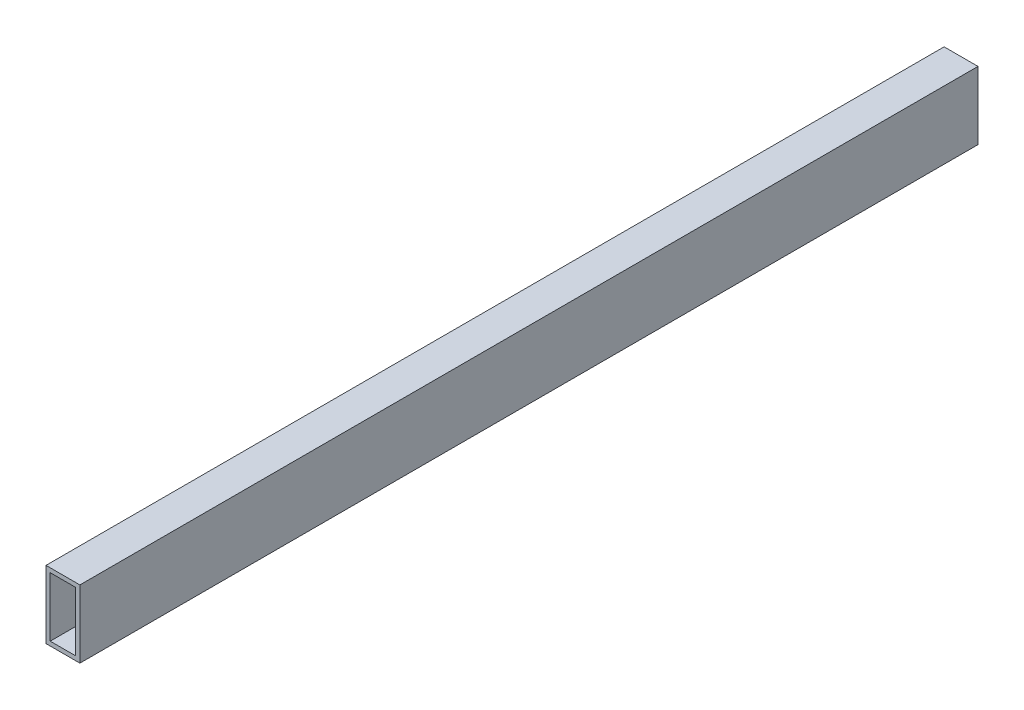
ISO-10303-21;
HEADER;
FILE_DESCRIPTION(('STEP AP214'),'2;1');
FILE_NAME('part.step','',(''),(''),'','','');
FILE_SCHEMA(('AUTOMOTIVE_DESIGN { 1 0 10303 214 1 1 1 1 }'));
ENDSEC;
DATA;
#1=APPLICATION_CONTEXT('core data for automotive mechanical design processes');
#2=APPLICATION_PROTOCOL_DEFINITION('international standard','automotive_design',2000,#1);
#3=PRODUCT_CONTEXT('',#1,'mechanical');
#4=PRODUCT('Part','Part','',(#3));
#5=PRODUCT_RELATED_PRODUCT_CATEGORY('part','',(#4));
#6=PRODUCT_DEFINITION_FORMATION('','',#4);
#7=PRODUCT_DEFINITION_CONTEXT('part definition',#1,'design');
#8=PRODUCT_DEFINITION('design','',#6,#7);
#9=PRODUCT_DEFINITION_SHAPE('','',#8);
#10=(LENGTH_UNIT() NAMED_UNIT(*) SI_UNIT(.MILLI.,.METRE.));
#11=(NAMED_UNIT(*) PLANE_ANGLE_UNIT() SI_UNIT($,.RADIAN.));
#12=(NAMED_UNIT(*) SI_UNIT($,.STERADIAN.) SOLID_ANGLE_UNIT());
#13=UNCERTAINTY_MEASURE_WITH_UNIT(LENGTH_MEASURE(1.E-05),#10,'distance_accuracy_value','');
#14=(GEOMETRIC_REPRESENTATION_CONTEXT(3) GLOBAL_UNCERTAINTY_ASSIGNED_CONTEXT((#13)) GLOBAL_UNIT_ASSIGNED_CONTEXT((#10,
#11,#12)) REPRESENTATION_CONTEXT('',''));
#15=CARTESIAN_POINT('',(0.,0.,0.));
#16=DIRECTION('',(0.,0.,1.));
#17=DIRECTION('',(1.,0.,0.));
#18=AXIS2_PLACEMENT_3D('',#15,#16,#17);
#19=CARTESIAN_POINT('',(0.,0.,673.1));
#20=DIRECTION('',(0.,0.,-1.));
#21=DIRECTION('',(-1.,0.,0.));
#22=AXIS2_PLACEMENT_3D('',#19,#20,#21);
#23=PLANE('',#22);
#24=DIRECTION('',(0.,1.,0.));
#25=VECTOR('',#24,1.);
#26=CARTESIAN_POINT('',(12.7,-25.4,673.1));
#27=LINE('',#26,#25);
#28=CARTESIAN_POINT('',(12.7,-25.4,673.1));
#29=VERTEX_POINT('',#28);
#30=CARTESIAN_POINT('',(12.7,25.4,673.1));
#31=VERTEX_POINT('',#30);
#32=EDGE_CURVE('E134',#29,#31,#27,.T.);
#33=ORIENTED_EDGE('',*,*,#32,.T.);
#34=DIRECTION('',(-1.,0.,0.));
#35=VECTOR('',#34,1.);
#36=CARTESIAN_POINT('',(-12.7,25.4,673.1));
#37=LINE('',#36,#35);
#38=CARTESIAN_POINT('',(-12.7,25.4,673.1));
#39=VERTEX_POINT('',#38);
#40=EDGE_CURVE('E137',#31,#39,#37,.T.);
#41=ORIENTED_EDGE('',*,*,#40,.T.);
#42=DIRECTION('',(0.,-1.,0.));
#43=VECTOR('',#42,1.);
#44=CARTESIAN_POINT('',(-12.7,-25.4,673.1));
#45=LINE('',#44,#43);
#46=CARTESIAN_POINT('',(-12.7,-25.4,673.1));
#47=VERTEX_POINT('',#46);
#48=EDGE_CURVE('E140',#39,#47,#45,.T.);
#49=ORIENTED_EDGE('',*,*,#48,.T.);
#50=DIRECTION('',(1.,0.,0.));
#51=VECTOR('',#50,1.);
#52=CARTESIAN_POINT('',(-12.7,-25.4,673.1));
#53=LINE('',#52,#51);
#54=EDGE_CURVE('E142',#47,#29,#53,.T.);
#55=ORIENTED_EDGE('',*,*,#54,.T.);
#56=EDGE_LOOP('',(#33,#41,#49,#55));
#57=FACE_BOUND('',#56,.T.);
#58=DIRECTION('',(0.,1.,0.));
#59=VECTOR('',#58,1.);
#60=CARTESIAN_POINT('',(9.525,-22.225,673.1));
#61=LINE('',#60,#59);
#62=CARTESIAN_POINT('',(9.525,-22.225,673.1));
#63=VERTEX_POINT('',#62);
#64=CARTESIAN_POINT('',(9.525,22.225,673.1));
#65=VERTEX_POINT('',#64);
#66=EDGE_CURVE('E98',#63,#65,#61,.T.);
#67=ORIENTED_EDGE('',*,*,#66,.F.);
#68=DIRECTION('',(1.,0.,0.));
#69=VECTOR('',#68,1.);
#70=CARTESIAN_POINT('',(-9.525,-22.225,673.1));
#71=LINE('',#70,#69);
#72=CARTESIAN_POINT('',(-9.525,-22.225,673.1));
#73=VERTEX_POINT('',#72);
#74=EDGE_CURVE('E120',#73,#63,#71,.T.);
#75=ORIENTED_EDGE('',*,*,#74,.F.);
#76=DIRECTION('',(0.,-1.,0.));
#77=VECTOR('',#76,1.);
#78=CARTESIAN_POINT('',(-9.525,-22.225,673.1));
#79=LINE('',#78,#77);
#80=CARTESIAN_POINT('',(-9.525,22.225,673.1));
#81=VERTEX_POINT('',#80);
#82=EDGE_CURVE('E118',#81,#73,#79,.T.);
#83=ORIENTED_EDGE('',*,*,#82,.F.);
#84=DIRECTION('',(-1.,0.,0.));
#85=VECTOR('',#84,1.);
#86=CARTESIAN_POINT('',(-9.525,22.225,673.1));
#87=LINE('',#86,#85);
#88=EDGE_CURVE('E106',#65,#81,#87,.T.);
#89=ORIENTED_EDGE('',*,*,#88,.F.);
#90=EDGE_LOOP('',(#67,#75,#83,#89));
#91=FACE_BOUND('',#90,.T.);
#92=ADVANCED_FACE('F33',(#57,#91),#23,.F.);
#93=CARTESIAN_POINT('',(0.,0.,0.));
#94=DIRECTION('',(0.,0.,-1.));
#95=DIRECTION('',(-1.,0.,0.));
#96=AXIS2_PLACEMENT_3D('',#93,#94,#95);
#97=PLANE('',#96);
#98=DIRECTION('',(0.,1.,0.));
#99=VECTOR('',#98,1.);
#100=CARTESIAN_POINT('',(12.7,-25.4,0.));
#101=LINE('',#100,#99);
#102=CARTESIAN_POINT('',(12.7,-25.4,0.));
#103=VERTEX_POINT('',#102);
#104=CARTESIAN_POINT('',(12.7,25.4,0.));
#105=VERTEX_POINT('',#104);
#106=EDGE_CURVE('E114',#103,#105,#101,.T.);
#107=ORIENTED_EDGE('',*,*,#106,.F.);
#108=DIRECTION('',(1.,0.,0.));
#109=VECTOR('',#108,1.);
#110=CARTESIAN_POINT('',(-12.7,-25.4,0.));
#111=LINE('',#110,#109);
#112=CARTESIAN_POINT('',(-12.7,-25.4,0.));
#113=VERTEX_POINT('',#112);
#114=EDGE_CURVE('E138',#113,#103,#111,.T.);
#115=ORIENTED_EDGE('',*,*,#114,.F.);
#116=DIRECTION('',(0.,-1.,0.));
#117=VECTOR('',#116,1.);
#118=CARTESIAN_POINT('',(-12.7,-25.4,0.));
#119=LINE('',#118,#117);
#120=CARTESIAN_POINT('',(-12.7,25.4,0.));
#121=VERTEX_POINT('',#120);
#122=EDGE_CURVE('E149',#121,#113,#119,.T.);
#123=ORIENTED_EDGE('',*,*,#122,.F.);
#124=DIRECTION('',(-1.,0.,0.));
#125=VECTOR('',#124,1.);
#126=CARTESIAN_POINT('',(-12.7,25.4,0.));
#127=LINE('',#126,#125);
#128=EDGE_CURVE('E147',#105,#121,#127,.T.);
#129=ORIENTED_EDGE('',*,*,#128,.F.);
#130=EDGE_LOOP('',(#107,#115,#123,#129));
#131=FACE_BOUND('',#130,.T.);
#132=DIRECTION('',(1.,0.,0.));
#133=VECTOR('',#132,1.);
#134=CARTESIAN_POINT('',(-9.525,-22.225,0.));
#135=LINE('',#134,#133);
#136=CARTESIAN_POINT('',(-9.525,-22.225,0.));
#137=VERTEX_POINT('',#136);
#138=CARTESIAN_POINT('',(9.525,-22.225,0.));
#139=VERTEX_POINT('',#138);
#140=EDGE_CURVE('E107',#137,#139,#135,.T.);
#141=ORIENTED_EDGE('',*,*,#140,.T.);
#142=DIRECTION('',(0.,1.,0.));
#143=VECTOR('',#142,1.);
#144=CARTESIAN_POINT('',(9.525,-22.225,0.));
#145=LINE('',#144,#143);
#146=CARTESIAN_POINT('',(9.525,22.225,0.));
#147=VERTEX_POINT('',#146);
#148=EDGE_CURVE('E56',#139,#147,#145,.T.);
#149=ORIENTED_EDGE('',*,*,#148,.T.);
#150=DIRECTION('',(-1.,0.,0.));
#151=VECTOR('',#150,1.);
#152=CARTESIAN_POINT('',(-9.525,22.225,0.));
#153=LINE('',#152,#151);
#154=CARTESIAN_POINT('',(-9.525,22.225,0.));
#155=VERTEX_POINT('',#154);
#156=EDGE_CURVE('E113',#147,#155,#153,.T.);
#157=ORIENTED_EDGE('',*,*,#156,.T.);
#158=DIRECTION('',(0.,-1.,0.));
#159=VECTOR('',#158,1.);
#160=CARTESIAN_POINT('',(-9.525,-22.225,0.));
#161=LINE('',#160,#159);
#162=EDGE_CURVE('E126',#155,#137,#161,.T.);
#163=ORIENTED_EDGE('',*,*,#162,.T.);
#164=EDGE_LOOP('',(#141,#149,#157,#163));
#165=FACE_BOUND('',#164,.T.);
#166=ADVANCED_FACE('F167',(#131,#165),#97,.T.);
#167=CARTESIAN_POINT('',(12.7,-25.4,673.1));
#168=DIRECTION('',(-1.,0.,0.));
#169=DIRECTION('',(0.,0.,1.));
#170=AXIS2_PLACEMENT_3D('',#167,#168,#169);
#171=PLANE('',#170);
#172=ORIENTED_EDGE('',*,*,#106,.T.);
#173=DIRECTION('',(0.,0.,-1.));
#174=VECTOR('',#173,1.);
#175=CARTESIAN_POINT('',(12.7,25.4,673.1));
#176=LINE('',#175,#174);
#177=EDGE_CURVE('E11',#31,#105,#176,.T.);
#178=ORIENTED_EDGE('',*,*,#177,.F.);
#179=ORIENTED_EDGE('',*,*,#32,.F.);
#180=DIRECTION('',(0.,0.,-1.));
#181=VECTOR('',#180,1.);
#182=CARTESIAN_POINT('',(12.7,-25.4,673.1));
#183=LINE('',#182,#181);
#184=EDGE_CURVE('E144',#29,#103,#183,.T.);
#185=ORIENTED_EDGE('',*,*,#184,.T.);
#186=EDGE_LOOP('',(#172,#178,#179,#185));
#187=FACE_BOUND('',#186,.T.);
#188=ADVANCED_FACE('F35',(#187),#171,.F.);
#189=CARTESIAN_POINT('',(-12.7,25.4,673.1));
#190=DIRECTION('',(0.,-1.,0.));
#191=DIRECTION('',(0.,0.,-1.));
#192=AXIS2_PLACEMENT_3D('',#189,#190,#191);
#193=PLANE('',#192);
#194=ORIENTED_EDGE('',*,*,#128,.T.);
#195=DIRECTION('',(0.,0.,-1.));
#196=VECTOR('',#195,1.);
#197=CARTESIAN_POINT('',(-12.7,25.4,673.1));
#198=LINE('',#197,#196);
#199=EDGE_CURVE('E41',#39,#121,#198,.T.);
#200=ORIENTED_EDGE('',*,*,#199,.F.);
#201=ORIENTED_EDGE('',*,*,#40,.F.);
#202=ORIENTED_EDGE('',*,*,#177,.T.);
#203=EDGE_LOOP('',(#194,#200,#201,#202));
#204=FACE_BOUND('',#203,.T.);
#205=ADVANCED_FACE('F177',(#204),#193,.F.);
#206=CARTESIAN_POINT('',(-12.7,-25.4,673.1));
#207=DIRECTION('',(1.,0.,0.));
#208=DIRECTION('',(0.,0.,-1.));
#209=AXIS2_PLACEMENT_3D('',#206,#207,#208);
#210=PLANE('',#209);
#211=ORIENTED_EDGE('',*,*,#122,.T.);
#212=DIRECTION('',(0.,0.,-1.));
#213=VECTOR('',#212,1.);
#214=CARTESIAN_POINT('',(-12.7,-25.4,673.1));
#215=LINE('',#214,#213);
#216=EDGE_CURVE('E154',#47,#113,#215,.T.);
#217=ORIENTED_EDGE('',*,*,#216,.F.);
#218=ORIENTED_EDGE('',*,*,#48,.F.);
#219=ORIENTED_EDGE('',*,*,#199,.T.);
#220=EDGE_LOOP('',(#211,#217,#218,#219));
#221=FACE_BOUND('',#220,.T.);
#222=ADVANCED_FACE('F161',(#221),#210,.F.);
#223=CARTESIAN_POINT('',(-12.7,-25.4,673.1));
#224=DIRECTION('',(0.,1.,0.));
#225=DIRECTION('',(0.,0.,1.));
#226=AXIS2_PLACEMENT_3D('',#223,#224,#225);
#227=PLANE('',#226);
#228=ORIENTED_EDGE('',*,*,#114,.T.);
#229=ORIENTED_EDGE('',*,*,#184,.F.);
#230=ORIENTED_EDGE('',*,*,#54,.F.);
#231=ORIENTED_EDGE('',*,*,#216,.T.);
#232=EDGE_LOOP('',(#228,#229,#230,#231));
#233=FACE_BOUND('',#232,.T.);
#234=ADVANCED_FACE('F171',(#233),#227,.F.);
#235=CARTESIAN_POINT('',(9.525,-22.225,673.1));
#236=DIRECTION('',(-1.,0.,0.));
#237=DIRECTION('',(0.,0.,1.));
#238=AXIS2_PLACEMENT_3D('',#235,#236,#237);
#239=PLANE('',#238);
#240=ORIENTED_EDGE('',*,*,#148,.F.);
#241=DIRECTION('',(0.,0.,-1.));
#242=VECTOR('',#241,1.);
#243=CARTESIAN_POINT('',(9.525,-22.225,673.1));
#244=LINE('',#243,#242);
#245=EDGE_CURVE('E102',#63,#139,#244,.T.);
#246=ORIENTED_EDGE('',*,*,#245,.F.);
#247=ORIENTED_EDGE('',*,*,#66,.T.);
#248=DIRECTION('',(0.,0.,-1.));
#249=VECTOR('',#248,1.);
#250=CARTESIAN_POINT('',(9.525,22.225,673.1));
#251=LINE('',#250,#249);
#252=EDGE_CURVE('E101',#65,#147,#251,.T.);
#253=ORIENTED_EDGE('',*,*,#252,.T.);
#254=EDGE_LOOP('',(#240,#246,#247,#253));
#255=FACE_BOUND('',#254,.T.);
#256=ADVANCED_FACE('F100',(#255),#239,.T.);
#257=CARTESIAN_POINT('',(-9.525,22.225,673.1));
#258=DIRECTION('',(0.,-1.,0.));
#259=DIRECTION('',(0.,0.,-1.));
#260=AXIS2_PLACEMENT_3D('',#257,#258,#259);
#261=PLANE('',#260);
#262=ORIENTED_EDGE('',*,*,#156,.F.);
#263=ORIENTED_EDGE('',*,*,#252,.F.);
#264=ORIENTED_EDGE('',*,*,#88,.T.);
#265=DIRECTION('',(0.,0.,-1.));
#266=VECTOR('',#265,1.);
#267=CARTESIAN_POINT('',(-9.525,22.225,673.1));
#268=LINE('',#267,#266);
#269=EDGE_CURVE('E115',#81,#155,#268,.T.);
#270=ORIENTED_EDGE('',*,*,#269,.T.);
#271=EDGE_LOOP('',(#262,#263,#264,#270));
#272=FACE_BOUND('',#271,.T.);
#273=ADVANCED_FACE('F110',(#272),#261,.T.);
#274=CARTESIAN_POINT('',(-9.525,-22.225,673.1));
#275=DIRECTION('',(1.,0.,0.));
#276=DIRECTION('',(0.,0.,-1.));
#277=AXIS2_PLACEMENT_3D('',#274,#275,#276);
#278=PLANE('',#277);
#279=ORIENTED_EDGE('',*,*,#162,.F.);
#280=ORIENTED_EDGE('',*,*,#269,.F.);
#281=ORIENTED_EDGE('',*,*,#82,.T.);
#282=DIRECTION('',(0.,0.,-1.));
#283=VECTOR('',#282,1.);
#284=CARTESIAN_POINT('',(-9.525,-22.225,673.1));
#285=LINE('',#284,#283);
#286=EDGE_CURVE('E48',#73,#137,#285,.T.);
#287=ORIENTED_EDGE('',*,*,#286,.T.);
#288=EDGE_LOOP('',(#279,#280,#281,#287));
#289=FACE_BOUND('',#288,.T.);
#290=ADVANCED_FACE('F200',(#289),#278,.T.);
#291=CARTESIAN_POINT('',(-9.525,-22.225,673.1));
#292=DIRECTION('',(0.,1.,0.));
#293=DIRECTION('',(0.,0.,1.));
#294=AXIS2_PLACEMENT_3D('',#291,#292,#293);
#295=PLANE('',#294);
#296=ORIENTED_EDGE('',*,*,#140,.F.);
#297=ORIENTED_EDGE('',*,*,#286,.F.);
#298=ORIENTED_EDGE('',*,*,#74,.T.);
#299=ORIENTED_EDGE('',*,*,#245,.T.);
#300=EDGE_LOOP('',(#296,#297,#298,#299));
#301=FACE_BOUND('',#300,.T.);
#302=ADVANCED_FACE('F204',(#301),#295,.T.);
#303=CLOSED_SHELL('',(#92,#166,#188,#205,#222,#234,#256,#273,#290,#302));
#304=MANIFOLD_SOLID_BREP('B2',#303);
#305=ADVANCED_BREP_SHAPE_REPRESENTATION('',(#18,#304),#14);
#306=SHAPE_DEFINITION_REPRESENTATION(#9,#305);
ENDSEC;
END-ISO-10303-21;
